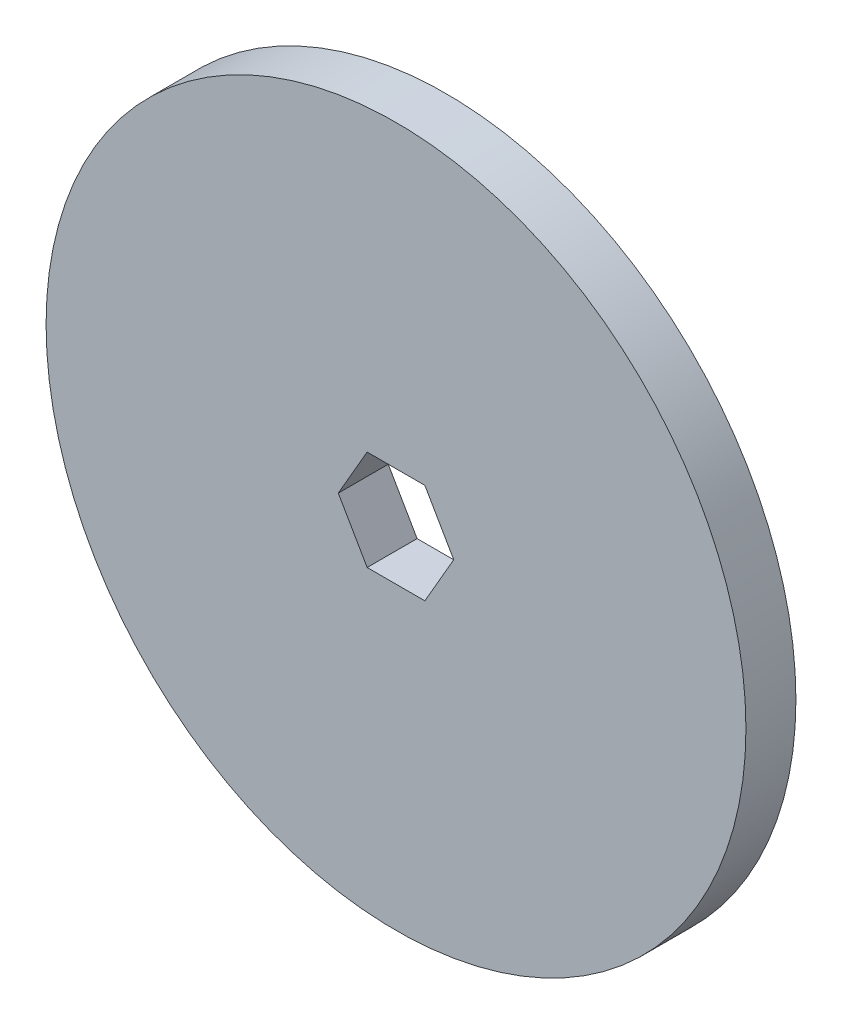
ISO-10303-21;
HEADER;
FILE_DESCRIPTION(('STEP AP214'),'2;1');
FILE_NAME('part.step','',(''),(''),'','','');
FILE_SCHEMA(('AUTOMOTIVE_DESIGN { 1 0 10303 214 1 1 1 1 }'));
ENDSEC;
DATA;
#1=APPLICATION_CONTEXT('core data for automotive mechanical design processes');
#2=APPLICATION_PROTOCOL_DEFINITION('international standard','automotive_design',2000,#1);
#3=PRODUCT_CONTEXT('',#1,'mechanical');
#4=PRODUCT('Part','Part','',(#3));
#5=PRODUCT_RELATED_PRODUCT_CATEGORY('part','',(#4));
#6=PRODUCT_DEFINITION_FORMATION('','',#4);
#7=PRODUCT_DEFINITION_CONTEXT('part definition',#1,'design');
#8=PRODUCT_DEFINITION('design','',#6,#7);
#9=PRODUCT_DEFINITION_SHAPE('','',#8);
#10=(LENGTH_UNIT() NAMED_UNIT(*) SI_UNIT(.MILLI.,.METRE.));
#11=(NAMED_UNIT(*) PLANE_ANGLE_UNIT() SI_UNIT($,.RADIAN.));
#12=(NAMED_UNIT(*) SI_UNIT($,.STERADIAN.) SOLID_ANGLE_UNIT());
#13=UNCERTAINTY_MEASURE_WITH_UNIT(LENGTH_MEASURE(1.E-05),#10,'distance_accuracy_value','');
#14=(GEOMETRIC_REPRESENTATION_CONTEXT(3) GLOBAL_UNCERTAINTY_ASSIGNED_CONTEXT((#13)) GLOBAL_UNIT_ASSIGNED_CONTEXT((#10,
#11,#12)) REPRESENTATION_CONTEXT('',''));
#15=CARTESIAN_POINT('',(0.,0.,0.));
#16=DIRECTION('',(0.,0.,1.));
#17=DIRECTION('',(1.,0.,0.));
#18=AXIS2_PLACEMENT_3D('',#15,#16,#17);
#19=CARTESIAN_POINT('',(0.,0.,3.175));
#20=DIRECTION('',(0.,0.,-1.));
#21=DIRECTION('',(-1.,0.,0.));
#22=AXIS2_PLACEMENT_3D('',#19,#20,#21);
#23=CYLINDRICAL_SURFACE('',#22,44.45);
#24=CARTESIAN_POINT('',(0.,0.,3.175));
#25=DIRECTION('',(0.,0.,1.));
#26=DIRECTION('',(1.,0.,0.));
#27=AXIS2_PLACEMENT_3D('',#24,#25,#26);
#28=CIRCLE('',#27,44.45);
#29=CARTESIAN_POINT('',(44.45,0.,3.175));
#30=VERTEX_POINT('',#29);
#31=EDGE_CURVE('E11',#30,#30,#28,.T.);
#32=ORIENTED_EDGE('',*,*,#31,.F.);
#33=EDGE_LOOP('',(#32));
#34=FACE_BOUND('',#33,.T.);
#35=CARTESIAN_POINT('',(0.,0.,-3.175));
#36=DIRECTION('',(0.,0.,1.));
#37=DIRECTION('',(1.,0.,0.));
#38=AXIS2_PLACEMENT_3D('',#35,#36,#37);
#39=CIRCLE('',#38,44.45);
#40=CARTESIAN_POINT('',(44.45,0.,-3.175));
#41=VERTEX_POINT('',#40);
#42=EDGE_CURVE('E36',#41,#41,#39,.T.);
#43=ORIENTED_EDGE('',*,*,#42,.T.);
#44=EDGE_LOOP('',(#43));
#45=FACE_BOUND('',#44,.T.);
#46=ADVANCED_FACE('F33',(#34,#45),#23,.T.);
#47=CARTESIAN_POINT('',(0.,0.,3.175));
#48=DIRECTION('',(0.,0.,1.));
#49=DIRECTION('',(1.,0.,0.));
#50=AXIS2_PLACEMENT_3D('',#47,#48,#49);
#51=PLANE('',#50);
#52=DIRECTION('',(0.5,0.866025403784439,0.));
#53=VECTOR('',#52,1.);
#54=CARTESIAN_POINT('',(3.66617420935412,-6.35,3.175));
#55=LINE('',#54,#53);
#56=CARTESIAN_POINT('',(3.66617420935412,-6.35,3.175));
#57=VERTEX_POINT('',#56);
#58=CARTESIAN_POINT('',(7.33234841870825,0.,3.175));
#59=VERTEX_POINT('',#58);
#60=EDGE_CURVE('E47',#57,#59,#55,.T.);
#61=ORIENTED_EDGE('',*,*,#60,.F.);
#62=DIRECTION('',(1.,0.,0.));
#63=VECTOR('',#62,1.);
#64=CARTESIAN_POINT('',(-3.66617420935412,-6.35,3.175));
#65=LINE('',#64,#63);
#66=CARTESIAN_POINT('',(-3.66617420935412,-6.35,3.175));
#67=VERTEX_POINT('',#66);
#68=EDGE_CURVE('E104',#67,#57,#65,.T.);
#69=ORIENTED_EDGE('',*,*,#68,.F.);
#70=DIRECTION('',(0.5,-0.866025403784438,0.));
#71=VECTOR('',#70,1.);
#72=CARTESIAN_POINT('',(-7.33234841870825,0.,3.175));
#73=LINE('',#72,#71);
#74=CARTESIAN_POINT('',(-7.33234841870825,0.,3.175));
#75=VERTEX_POINT('',#74);
#76=EDGE_CURVE('E107',#75,#67,#73,.T.);
#77=ORIENTED_EDGE('',*,*,#76,.F.);
#78=DIRECTION('',(-0.5,-0.866025403784439,0.));
#79=VECTOR('',#78,1.);
#80=CARTESIAN_POINT('',(-3.66617420935412,6.35,3.175));
#81=LINE('',#80,#79);
#82=CARTESIAN_POINT('',(-3.66617420935412,6.35,3.175));
#83=VERTEX_POINT('',#82);
#84=EDGE_CURVE('E123',#83,#75,#81,.T.);
#85=ORIENTED_EDGE('',*,*,#84,.F.);
#86=DIRECTION('',(-1.,0.,0.));
#87=VECTOR('',#86,1.);
#88=CARTESIAN_POINT('',(3.66617420935412,6.35,3.175));
#89=LINE('',#88,#87);
#90=CARTESIAN_POINT('',(3.66617420935412,6.35,3.175));
#91=VERTEX_POINT('',#90);
#92=EDGE_CURVE('E120',#91,#83,#89,.T.);
#93=ORIENTED_EDGE('',*,*,#92,.F.);
#94=DIRECTION('',(-0.5,0.866025403784438,0.));
#95=VECTOR('',#94,1.);
#96=CARTESIAN_POINT('',(7.33234841870825,0.,3.175));
#97=LINE('',#96,#95);
#98=EDGE_CURVE('E118',#59,#91,#97,.T.);
#99=ORIENTED_EDGE('',*,*,#98,.F.);
#100=EDGE_LOOP('',(#61,#69,#77,#85,#93,#99));
#101=FACE_BOUND('',#100,.T.);
#102=ORIENTED_EDGE('',*,*,#31,.T.);
#103=EDGE_LOOP('',(#102));
#104=FACE_BOUND('',#103,.T.);
#105=ADVANCED_FACE('F140',(#101,#104),#51,.T.);
#106=CARTESIAN_POINT('',(0.,0.,-3.175));
#107=DIRECTION('',(0.,0.,1.));
#108=DIRECTION('',(1.,0.,0.));
#109=AXIS2_PLACEMENT_3D('',#106,#107,#108);
#110=PLANE('',#109);
#111=DIRECTION('',(1.,0.,0.));
#112=VECTOR('',#111,1.);
#113=CARTESIAN_POINT('',(-3.66617420935412,-6.35,-3.175));
#114=LINE('',#113,#112);
#115=CARTESIAN_POINT('',(-3.66617420935412,-6.35,-3.175));
#116=VERTEX_POINT('',#115);
#117=CARTESIAN_POINT('',(3.66617420935412,-6.35,-3.175));
#118=VERTEX_POINT('',#117);
#119=EDGE_CURVE('E93',#116,#118,#114,.T.);
#120=ORIENTED_EDGE('',*,*,#119,.T.);
#121=DIRECTION('',(0.5,0.866025403784439,0.));
#122=VECTOR('',#121,1.);
#123=CARTESIAN_POINT('',(3.66617420935412,-6.35,-3.175));
#124=LINE('',#123,#122);
#125=CARTESIAN_POINT('',(7.33234841870825,0.,-3.175));
#126=VERTEX_POINT('',#125);
#127=EDGE_CURVE('E87',#118,#126,#124,.T.);
#128=ORIENTED_EDGE('',*,*,#127,.T.);
#129=DIRECTION('',(-0.5,0.866025403784438,0.));
#130=VECTOR('',#129,1.);
#131=CARTESIAN_POINT('',(7.33234841870825,0.,-3.175));
#132=LINE('',#131,#130);
#133=CARTESIAN_POINT('',(3.66617420935412,6.35,-3.175));
#134=VERTEX_POINT('',#133);
#135=EDGE_CURVE('E96',#126,#134,#132,.T.);
#136=ORIENTED_EDGE('',*,*,#135,.T.);
#137=DIRECTION('',(-1.,0.,0.));
#138=VECTOR('',#137,1.);
#139=CARTESIAN_POINT('',(3.66617420935412,6.35,-3.175));
#140=LINE('',#139,#138);
#141=CARTESIAN_POINT('',(-3.66617420935412,6.35,-3.175));
#142=VERTEX_POINT('',#141);
#143=EDGE_CURVE('E55',#134,#142,#140,.T.);
#144=ORIENTED_EDGE('',*,*,#143,.T.);
#145=DIRECTION('',(-0.5,-0.866025403784439,0.));
#146=VECTOR('',#145,1.);
#147=CARTESIAN_POINT('',(-3.66617420935412,6.35,-3.175));
#148=LINE('',#147,#146);
#149=CARTESIAN_POINT('',(-7.33234841870825,0.,-3.175));
#150=VERTEX_POINT('',#149);
#151=EDGE_CURVE('E111',#142,#150,#148,.T.);
#152=ORIENTED_EDGE('',*,*,#151,.T.);
#153=DIRECTION('',(0.5,-0.866025403784438,0.));
#154=VECTOR('',#153,1.);
#155=CARTESIAN_POINT('',(-7.33234841870825,0.,-3.175));
#156=LINE('',#155,#154);
#157=EDGE_CURVE('E114',#150,#116,#156,.T.);
#158=ORIENTED_EDGE('',*,*,#157,.T.);
#159=EDGE_LOOP('',(#120,#128,#136,#144,#152,#158));
#160=FACE_BOUND('',#159,.T.);
#161=ORIENTED_EDGE('',*,*,#42,.F.);
#162=EDGE_LOOP('',(#161));
#163=FACE_BOUND('',#162,.T.);
#164=ADVANCED_FACE('F100',(#160,#163),#110,.F.);
#165=CARTESIAN_POINT('',(3.66617420935412,-6.35,-3.175));
#166=DIRECTION('',(0.866025403784439,-0.5,0.));
#167=DIRECTION('',(0.5,0.866025403784439,0.));
#168=AXIS2_PLACEMENT_3D('',#165,#166,#167);
#169=PLANE('',#168);
#170=ORIENTED_EDGE('',*,*,#60,.T.);
#171=DIRECTION('',(0.,0.,1.));
#172=VECTOR('',#171,1.);
#173=CARTESIAN_POINT('',(7.33234841870825,0.,-3.175));
#174=LINE('',#173,#172);
#175=EDGE_CURVE('E83',#126,#59,#174,.T.);
#176=ORIENTED_EDGE('',*,*,#175,.F.);
#177=ORIENTED_EDGE('',*,*,#127,.F.);
#178=DIRECTION('',(0.,0.,1.));
#179=VECTOR('',#178,1.);
#180=CARTESIAN_POINT('',(3.66617420935412,-6.35,-3.175));
#181=LINE('',#180,#179);
#182=EDGE_CURVE('E128',#118,#57,#181,.T.);
#183=ORIENTED_EDGE('',*,*,#182,.T.);
#184=EDGE_LOOP('',(#170,#176,#177,#183));
#185=FACE_BOUND('',#184,.T.);
#186=ADVANCED_FACE('F85',(#185),#169,.F.);
#187=CARTESIAN_POINT('',(-3.66617420935412,-6.35,-3.175));
#188=DIRECTION('',(0.,-1.,0.));
#189=DIRECTION('',(1.,0.,0.));
#190=AXIS2_PLACEMENT_3D('',#187,#188,#189);
#191=PLANE('',#190);
#192=ORIENTED_EDGE('',*,*,#68,.T.);
#193=ORIENTED_EDGE('',*,*,#182,.F.);
#194=ORIENTED_EDGE('',*,*,#119,.F.);
#195=DIRECTION('',(0.,0.,1.));
#196=VECTOR('',#195,1.);
#197=CARTESIAN_POINT('',(-3.66617420935412,-6.35,-3.175));
#198=LINE('',#197,#196);
#199=EDGE_CURVE('E130',#116,#67,#198,.T.);
#200=ORIENTED_EDGE('',*,*,#199,.T.);
#201=EDGE_LOOP('',(#192,#193,#194,#200));
#202=FACE_BOUND('',#201,.T.);
#203=ADVANCED_FACE('F151',(#202),#191,.F.);
#204=CARTESIAN_POINT('',(-7.33234841870825,0.,-3.175));
#205=DIRECTION('',(-0.866025403784439,-0.5,0.));
#206=DIRECTION('',(0.5,-0.866025403784439,0.));
#207=AXIS2_PLACEMENT_3D('',#204,#205,#206);
#208=PLANE('',#207);
#209=ORIENTED_EDGE('',*,*,#76,.T.);
#210=ORIENTED_EDGE('',*,*,#199,.F.);
#211=ORIENTED_EDGE('',*,*,#157,.F.);
#212=DIRECTION('',(0.,0.,1.));
#213=VECTOR('',#212,1.);
#214=CARTESIAN_POINT('',(-7.33234841870825,0.,-3.175));
#215=LINE('',#214,#213);
#216=EDGE_CURVE('E132',#150,#75,#215,.T.);
#217=ORIENTED_EDGE('',*,*,#216,.T.);
#218=EDGE_LOOP('',(#209,#210,#211,#217));
#219=FACE_BOUND('',#218,.T.);
#220=ADVANCED_FACE('F149',(#219),#208,.F.);
#221=CARTESIAN_POINT('',(-3.66617420935412,6.35,-3.175));
#222=DIRECTION('',(-0.866025403784439,0.5,0.));
#223=DIRECTION('',(-0.5,-0.866025403784439,0.));
#224=AXIS2_PLACEMENT_3D('',#221,#222,#223);
#225=PLANE('',#224);
#226=ORIENTED_EDGE('',*,*,#84,.T.);
#227=ORIENTED_EDGE('',*,*,#216,.F.);
#228=ORIENTED_EDGE('',*,*,#151,.F.);
#229=DIRECTION('',(0.,0.,1.));
#230=VECTOR('',#229,1.);
#231=CARTESIAN_POINT('',(-3.66617420935412,6.35,-3.175));
#232=LINE('',#231,#230);
#233=EDGE_CURVE('E134',#142,#83,#232,.T.);
#234=ORIENTED_EDGE('',*,*,#233,.T.);
#235=EDGE_LOOP('',(#226,#227,#228,#234));
#236=FACE_BOUND('',#235,.T.);
#237=ADVANCED_FACE('F145',(#236),#225,.F.);
#238=CARTESIAN_POINT('',(3.66617420935412,6.35,-3.175));
#239=DIRECTION('',(0.,1.,0.));
#240=DIRECTION('',(0.,0.,1.));
#241=AXIS2_PLACEMENT_3D('',#238,#239,#240);
#242=PLANE('',#241);
#243=ORIENTED_EDGE('',*,*,#92,.T.);
#244=ORIENTED_EDGE('',*,*,#233,.F.);
#245=ORIENTED_EDGE('',*,*,#143,.F.);
#246=DIRECTION('',(0.,0.,1.));
#247=VECTOR('',#246,1.);
#248=CARTESIAN_POINT('',(3.66617420935412,6.35,-3.175));
#249=LINE('',#248,#247);
#250=EDGE_CURVE('E92',#134,#91,#249,.T.);
#251=ORIENTED_EDGE('',*,*,#250,.T.);
#252=EDGE_LOOP('',(#243,#244,#245,#251));
#253=FACE_BOUND('',#252,.T.);
#254=ADVANCED_FACE('F136',(#253),#242,.F.);
#255=CARTESIAN_POINT('',(7.33234841870825,0.,-3.175));
#256=DIRECTION('',(0.866025403784438,0.5,0.));
#257=DIRECTION('',(-0.5,0.866025403784439,0.));
#258=AXIS2_PLACEMENT_3D('',#255,#256,#257);
#259=PLANE('',#258);
#260=ORIENTED_EDGE('',*,*,#98,.T.);
#261=ORIENTED_EDGE('',*,*,#250,.F.);
#262=ORIENTED_EDGE('',*,*,#135,.F.);
#263=ORIENTED_EDGE('',*,*,#175,.T.);
#264=EDGE_LOOP('',(#260,#261,#262,#263));
#265=FACE_BOUND('',#264,.T.);
#266=ADVANCED_FACE('F97',(#265),#259,.F.);
#267=CLOSED_SHELL('',(#46,#105,#164,#186,#203,#220,#237,#254,#266));
#268=MANIFOLD_SOLID_BREP('B2',#267);
#269=ADVANCED_BREP_SHAPE_REPRESENTATION('',(#18,#268),#14);
#270=SHAPE_DEFINITION_REPRESENTATION(#9,#269);
ENDSEC;
END-ISO-10303-21;
